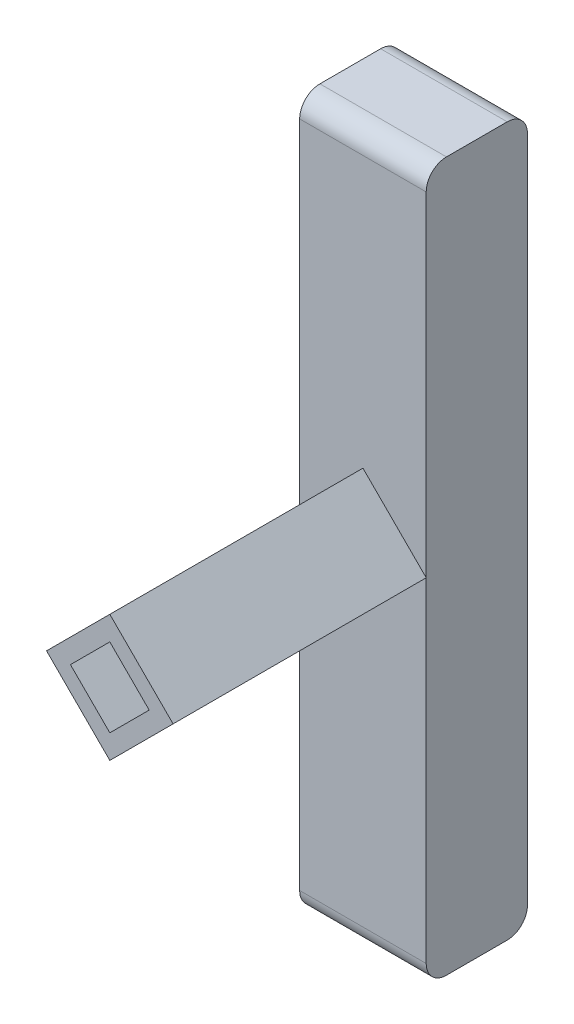
ISO-10303-21;
HEADER;
FILE_DESCRIPTION(('STEP AP214'),'2;1');
FILE_NAME('part.step','',(''),(''),'','','');
FILE_SCHEMA(('AUTOMOTIVE_DESIGN { 1 0 10303 214 1 1 1 1 }'));
ENDSEC;
DATA;
#1=APPLICATION_CONTEXT('core data for automotive mechanical design processes');
#2=APPLICATION_PROTOCOL_DEFINITION('international standard','automotive_design',2000,#1);
#3=PRODUCT_CONTEXT('',#1,'mechanical');
#4=PRODUCT('Part','Part','',(#3));
#5=PRODUCT_RELATED_PRODUCT_CATEGORY('part','',(#4));
#6=PRODUCT_DEFINITION_FORMATION('','',#4);
#7=PRODUCT_DEFINITION_CONTEXT('part definition',#1,'design');
#8=PRODUCT_DEFINITION('design','',#6,#7);
#9=PRODUCT_DEFINITION_SHAPE('','',#8);
#10=(LENGTH_UNIT() NAMED_UNIT(*) SI_UNIT(.MILLI.,.METRE.));
#11=(NAMED_UNIT(*) PLANE_ANGLE_UNIT() SI_UNIT($,.RADIAN.));
#12=(NAMED_UNIT(*) SI_UNIT($,.STERADIAN.) SOLID_ANGLE_UNIT());
#13=UNCERTAINTY_MEASURE_WITH_UNIT(LENGTH_MEASURE(1.E-05),#10,'distance_accuracy_value','');
#14=(GEOMETRIC_REPRESENTATION_CONTEXT(3) GLOBAL_UNCERTAINTY_ASSIGNED_CONTEXT((#13)) GLOBAL_UNIT_ASSIGNED_CONTEXT((#10,
#11,#12)) REPRESENTATION_CONTEXT('',''));
#15=CARTESIAN_POINT('',(0.,0.,0.));
#16=DIRECTION('',(0.,0.,1.));
#17=DIRECTION('',(1.,0.,0.));
#18=AXIS2_PLACEMENT_3D('',#15,#16,#17);
#19=CARTESIAN_POINT('',(0.,0.,10.));
#20=DIRECTION('',(0.,0.,1.));
#21=DIRECTION('',(1.,0.,0.));
#22=AXIS2_PLACEMENT_3D('',#19,#20,#21);
#23=PLANE('',#22);
#24=DIRECTION('',(0.,-1.,0.));
#25=VECTOR('',#24,1.);
#26=CARTESIAN_POINT('',(-6.25000000000001,35.,10.));
#27=LINE('',#26,#25);
#28=CARTESIAN_POINT('',(-6.25,0.,10.));
#29=VERTEX_POINT('',#28);
#30=CARTESIAN_POINT('',(-6.25,-33.,10.));
#31=VERTEX_POINT('',#30);
#32=EDGE_CURVE('E222',#29,#31,#27,.T.);
#33=ORIENTED_EDGE('',*,*,#32,.T.);
#34=DIRECTION('',(1.,0.,0.));
#35=VECTOR('',#34,1.);
#36=CARTESIAN_POINT('',(6.25000000000001,-33.,10.));
#37=LINE('',#36,#35);
#38=CARTESIAN_POINT('',(6.25000000000001,-33.,10.));
#39=VERTEX_POINT('',#38);
#40=EDGE_CURVE('E249',#31,#39,#37,.T.);
#41=ORIENTED_EDGE('',*,*,#40,.T.);
#42=DIRECTION('',(0.,1.,0.));
#43=VECTOR('',#42,1.);
#44=CARTESIAN_POINT('',(6.25,35.,10.));
#45=LINE('',#44,#43);
#46=CARTESIAN_POINT('',(6.25,0.,10.));
#47=VERTEX_POINT('',#46);
#48=EDGE_CURVE('E220',#39,#47,#45,.T.);
#49=ORIENTED_EDGE('',*,*,#48,.T.);
#50=DIRECTION('',(0.707106781186548,0.707106781186547,0.));
#51=VECTOR('',#50,1.);
#52=CARTESIAN_POINT('',(3.125,-3.125,10.));
#53=LINE('',#52,#51);
#54=CARTESIAN_POINT('',(0.,-6.25,10.));
#55=VERTEX_POINT('',#54);
#56=EDGE_CURVE('E213',#55,#47,#53,.T.);
#57=ORIENTED_EDGE('',*,*,#56,.F.);
#58=DIRECTION('',(0.707106781186548,-0.707106781186547,0.));
#59=VECTOR('',#58,1.);
#60=CARTESIAN_POINT('',(-3.125,-3.125,10.));
#61=LINE('',#60,#59);
#62=EDGE_CURVE('E216',#29,#55,#61,.T.);
#63=ORIENTED_EDGE('',*,*,#62,.F.);
#64=EDGE_LOOP('',(#33,#41,#49,#57,#63));
#65=FACE_BOUND('',#64,.T.);
#66=ADVANCED_FACE('F33',(#65),#23,.T.);
#67=CARTESIAN_POINT('',(6.25,35.,10.));
#68=DIRECTION('',(-1.,0.,0.));
#69=DIRECTION('',(0.,-1.,0.));
#70=AXIS2_PLACEMENT_3D('',#67,#68,#69);
#71=PLANE('',#70);
#72=ORIENTED_EDGE('',*,*,#48,.F.);
#73=CARTESIAN_POINT('',(6.25000000000001,-33.,8.));
#74=DIRECTION('',(-1.,0.,0.));
#75=DIRECTION('',(0.,-1.,0.));
#76=AXIS2_PLACEMENT_3D('',#73,#74,#75);
#77=CIRCLE('',#76,2.);
#78=CARTESIAN_POINT('',(6.25000000000001,-35.,8.));
#79=VERTEX_POINT('',#78);
#80=EDGE_CURVE('E258',#39,#79,#77,.F.);
#81=ORIENTED_EDGE('',*,*,#80,.T.);
#82=DIRECTION('',(0.,0.,-1.));
#83=VECTOR('',#82,1.);
#84=CARTESIAN_POINT('',(6.25000000000001,-35.,10.));
#85=LINE('',#84,#83);
#86=CARTESIAN_POINT('',(6.25000000000001,-35.,2.));
#87=VERTEX_POINT('',#86);
#88=EDGE_CURVE('E226',#79,#87,#85,.T.);
#89=ORIENTED_EDGE('',*,*,#88,.T.);
#90=CARTESIAN_POINT('',(6.25000000000001,-33.,2.));
#91=DIRECTION('',(-1.,0.,0.));
#92=DIRECTION('',(0.,-1.,0.));
#93=AXIS2_PLACEMENT_3D('',#90,#91,#92);
#94=CIRCLE('',#93,2.);
#95=CARTESIAN_POINT('',(6.25000000000001,-33.,0.));
#96=VERTEX_POINT('',#95);
#97=EDGE_CURVE('E256',#87,#96,#94,.F.);
#98=ORIENTED_EDGE('',*,*,#97,.T.);
#99=DIRECTION('',(0.,1.,0.));
#100=VECTOR('',#99,1.);
#101=CARTESIAN_POINT('',(6.25,35.,0.));
#102=LINE('',#101,#100);
#103=CARTESIAN_POINT('',(6.25,33.,0.));
#104=VERTEX_POINT('',#103);
#105=EDGE_CURVE('E219',#96,#104,#102,.T.);
#106=ORIENTED_EDGE('',*,*,#105,.T.);
#107=CARTESIAN_POINT('',(6.25,33.,2.));
#108=DIRECTION('',(-1.,0.,0.));
#109=DIRECTION('',(0.,-1.,0.));
#110=AXIS2_PLACEMENT_3D('',#107,#108,#109);
#111=CIRCLE('',#110,2.);
#112=CARTESIAN_POINT('',(6.25,35.,2.));
#113=VERTEX_POINT('',#112);
#114=EDGE_CURVE('E254',#104,#113,#111,.F.);
#115=ORIENTED_EDGE('',*,*,#114,.T.);
#116=DIRECTION('',(0.,0.,-1.));
#117=VECTOR('',#116,1.);
#118=CARTESIAN_POINT('',(6.25,35.,10.));
#119=LINE('',#118,#117);
#120=CARTESIAN_POINT('',(6.25,35.,8.));
#121=VERTEX_POINT('',#120);
#122=EDGE_CURVE('E239',#121,#113,#119,.T.);
#123=ORIENTED_EDGE('',*,*,#122,.F.);
#124=CARTESIAN_POINT('',(6.25,33.,8.));
#125=DIRECTION('',(-1.,0.,0.));
#126=DIRECTION('',(0.,-1.,0.));
#127=AXIS2_PLACEMENT_3D('',#124,#125,#126);
#128=CIRCLE('',#127,2.);
#129=CARTESIAN_POINT('',(6.25,33.,10.));
#130=VERTEX_POINT('',#129);
#131=EDGE_CURVE('E252',#121,#130,#128,.F.);
#132=ORIENTED_EDGE('',*,*,#131,.T.);
#133=EDGE_CURVE('E223',#47,#130,#45,.T.);
#134=ORIENTED_EDGE('',*,*,#133,.F.);
#135=EDGE_LOOP('',(#72,#81,#89,#98,#106,#115,#123,#132,#134));
#136=FACE_BOUND('',#135,.T.);
#137=ADVANCED_FACE('F290',(#136),#71,.F.);
#138=CARTESIAN_POINT('',(-6.25000000000001,35.,10.));
#139=DIRECTION('',(0.,-1.,0.));
#140=DIRECTION('',(0.,0.,-1.));
#141=AXIS2_PLACEMENT_3D('',#138,#139,#140);
#142=PLANE('',#141);
#143=ORIENTED_EDGE('',*,*,#122,.T.);
#144=DIRECTION('',(-1.,0.,0.));
#145=VECTOR('',#144,1.);
#146=CARTESIAN_POINT('',(-6.25000000000001,35.,2.));
#147=LINE('',#146,#145);
#148=CARTESIAN_POINT('',(-6.25000000000001,35.,2.));
#149=VERTEX_POINT('',#148);
#150=EDGE_CURVE('E41',#113,#149,#147,.T.);
#151=ORIENTED_EDGE('',*,*,#150,.T.);
#152=DIRECTION('',(0.,0.,-1.));
#153=VECTOR('',#152,1.);
#154=CARTESIAN_POINT('',(-6.25000000000001,35.,10.));
#155=LINE('',#154,#153);
#156=CARTESIAN_POINT('',(-6.25000000000001,35.,8.));
#157=VERTEX_POINT('',#156);
#158=EDGE_CURVE('E237',#157,#149,#155,.T.);
#159=ORIENTED_EDGE('',*,*,#158,.F.);
#160=DIRECTION('',(-1.,0.,0.));
#161=VECTOR('',#160,1.);
#162=CARTESIAN_POINT('',(6.25,35.,8.));
#163=LINE('',#162,#161);
#164=EDGE_CURVE('E275',#157,#121,#163,.F.);
#165=ORIENTED_EDGE('',*,*,#164,.T.);
#166=EDGE_LOOP('',(#143,#151,#159,#165));
#167=FACE_BOUND('',#166,.T.);
#168=ADVANCED_FACE('F277',(#167),#142,.F.);
#169=CARTESIAN_POINT('',(-6.25000000000001,35.,10.));
#170=DIRECTION('',(1.,0.,0.));
#171=DIRECTION('',(0.,1.,0.));
#172=AXIS2_PLACEMENT_3D('',#169,#170,#171);
#173=PLANE('',#172);
#174=DIRECTION('',(0.,0.,-1.));
#175=VECTOR('',#174,1.);
#176=CARTESIAN_POINT('',(-6.25,-35.,10.));
#177=LINE('',#176,#175);
#178=CARTESIAN_POINT('',(-6.25,-35.,8.));
#179=VERTEX_POINT('',#178);
#180=CARTESIAN_POINT('',(-6.25,-35.,2.));
#181=VERTEX_POINT('',#180);
#182=EDGE_CURVE('E234',#179,#181,#177,.T.);
#183=ORIENTED_EDGE('',*,*,#182,.F.);
#184=CARTESIAN_POINT('',(-6.25,-33.,8.));
#185=DIRECTION('',(1.,0.,0.));
#186=DIRECTION('',(0.,1.,0.));
#187=AXIS2_PLACEMENT_3D('',#184,#185,#186);
#188=CIRCLE('',#187,2.);
#189=EDGE_CURVE('E269',#179,#31,#188,.F.);
#190=ORIENTED_EDGE('',*,*,#189,.T.);
#191=ORIENTED_EDGE('',*,*,#32,.F.);
#192=CARTESIAN_POINT('',(-6.25000000000001,33.,10.));
#193=VERTEX_POINT('',#192);
#194=EDGE_CURVE('E224',#193,#29,#27,.T.);
#195=ORIENTED_EDGE('',*,*,#194,.F.);
#196=CARTESIAN_POINT('',(-6.25000000000001,33.,8.));
#197=DIRECTION('',(1.,0.,0.));
#198=DIRECTION('',(0.,1.,0.));
#199=AXIS2_PLACEMENT_3D('',#196,#197,#198);
#200=CIRCLE('',#199,2.);
#201=EDGE_CURVE('E56',#193,#157,#200,.F.);
#202=ORIENTED_EDGE('',*,*,#201,.T.);
#203=ORIENTED_EDGE('',*,*,#158,.T.);
#204=CARTESIAN_POINT('',(-6.25000000000001,33.,2.));
#205=DIRECTION('',(1.,0.,0.));
#206=DIRECTION('',(0.,1.,0.));
#207=AXIS2_PLACEMENT_3D('',#204,#205,#206);
#208=CIRCLE('',#207,2.);
#209=CARTESIAN_POINT('',(-6.25000000000001,33.,0.));
#210=VERTEX_POINT('',#209);
#211=EDGE_CURVE('E48',#149,#210,#208,.F.);
#212=ORIENTED_EDGE('',*,*,#211,.T.);
#213=DIRECTION('',(0.,-1.,0.));
#214=VECTOR('',#213,1.);
#215=CARTESIAN_POINT('',(-6.25000000000001,35.,0.));
#216=LINE('',#215,#214);
#217=CARTESIAN_POINT('',(-6.25,-33.,0.));
#218=VERTEX_POINT('',#217);
#219=EDGE_CURVE('E229',#210,#218,#216,.T.);
#220=ORIENTED_EDGE('',*,*,#219,.T.);
#221=CARTESIAN_POINT('',(-6.25,-33.,2.));
#222=DIRECTION('',(1.,0.,0.));
#223=DIRECTION('',(0.,1.,0.));
#224=AXIS2_PLACEMENT_3D('',#221,#222,#223);
#225=CIRCLE('',#224,2.);
#226=EDGE_CURVE('E267',#218,#181,#225,.F.);
#227=ORIENTED_EDGE('',*,*,#226,.T.);
#228=EDGE_LOOP('',(#183,#190,#191,#195,#202,#203,#212,#220,#227));
#229=FACE_BOUND('',#228,.T.);
#230=ADVANCED_FACE('F282',(#229),#173,.F.);
#231=CARTESIAN_POINT('',(-6.25,-35.,10.));
#232=DIRECTION('',(0.,1.,0.));
#233=DIRECTION('',(0.,0.,1.));
#234=AXIS2_PLACEMENT_3D('',#231,#232,#233);
#235=PLANE('',#234);
#236=ORIENTED_EDGE('',*,*,#88,.F.);
#237=DIRECTION('',(1.,0.,0.));
#238=VECTOR('',#237,1.);
#239=CARTESIAN_POINT('',(-6.25,-35.,8.));
#240=LINE('',#239,#238);
#241=EDGE_CURVE('E263',#79,#179,#240,.F.);
#242=ORIENTED_EDGE('',*,*,#241,.T.);
#243=ORIENTED_EDGE('',*,*,#182,.T.);
#244=DIRECTION('',(1.,0.,0.));
#245=VECTOR('',#244,1.);
#246=CARTESIAN_POINT('',(-6.25,-35.,2.));
#247=LINE('',#246,#245);
#248=EDGE_CURVE('E260',#181,#87,#247,.T.);
#249=ORIENTED_EDGE('',*,*,#248,.T.);
#250=EDGE_LOOP('',(#236,#242,#243,#249));
#251=FACE_BOUND('',#250,.T.);
#252=ADVANCED_FACE('F298',(#251),#235,.F.);
#253=ORIENTED_EDGE('',*,*,#133,.T.);
#254=DIRECTION('',(-1.,0.,0.));
#255=VECTOR('',#254,1.);
#256=CARTESIAN_POINT('',(-6.25000000000001,33.,10.));
#257=LINE('',#256,#255);
#258=EDGE_CURVE('E11',#130,#193,#257,.T.);
#259=ORIENTED_EDGE('',*,*,#258,.T.);
#260=ORIENTED_EDGE('',*,*,#194,.T.);
#261=DIRECTION('',(-0.707106781186548,-0.707106781186547,0.));
#262=VECTOR('',#261,1.);
#263=CARTESIAN_POINT('',(-3.125,3.125,10.));
#264=LINE('',#263,#262);
#265=CARTESIAN_POINT('',(0.,6.25,10.));
#266=VERTEX_POINT('',#265);
#267=EDGE_CURVE('E199',#266,#29,#264,.T.);
#268=ORIENTED_EDGE('',*,*,#267,.F.);
#269=DIRECTION('',(-0.707106781186548,0.707106781186548,0.));
#270=VECTOR('',#269,1.);
#271=CARTESIAN_POINT('',(3.125,3.125,10.));
#272=LINE('',#271,#270);
#273=EDGE_CURVE('E210',#47,#266,#272,.T.);
#274=ORIENTED_EDGE('',*,*,#273,.F.);
#275=EDGE_LOOP('',(#253,#259,#260,#268,#274));
#276=FACE_BOUND('',#275,.T.);
#277=ADVANCED_FACE('F325',(#276),#23,.T.);
#278=CARTESIAN_POINT('',(0.,0.,0.));
#279=DIRECTION('',(0.,0.,1.));
#280=DIRECTION('',(1.,0.,0.));
#281=AXIS2_PLACEMENT_3D('',#278,#279,#280);
#282=PLANE('',#281);
#283=DIRECTION('',(0.707106781186548,-0.707106781186547,0.));
#284=VECTOR('',#283,1.);
#285=CARTESIAN_POINT('',(3.88908729652601,0.,0.));
#286=LINE('',#285,#284);
#287=CARTESIAN_POINT('',(0.,3.88908729652601,0.));
#288=VERTEX_POINT('',#287);
#289=CARTESIAN_POINT('',(3.88908729652601,0.,0.));
#290=VERTEX_POINT('',#289);
#291=EDGE_CURVE('E164',#288,#290,#286,.T.);
#292=ORIENTED_EDGE('',*,*,#291,.F.);
#293=DIRECTION('',(0.707106781186548,0.707106781186548,0.));
#294=VECTOR('',#293,1.);
#295=CARTESIAN_POINT('',(0.,3.88908729652601,0.));
#296=LINE('',#295,#294);
#297=CARTESIAN_POINT('',(-3.88908729652601,0.,0.));
#298=VERTEX_POINT('',#297);
#299=EDGE_CURVE('E169',#298,#288,#296,.T.);
#300=ORIENTED_EDGE('',*,*,#299,.F.);
#301=DIRECTION('',(-0.707106781186548,0.707106781186548,0.));
#302=VECTOR('',#301,1.);
#303=CARTESIAN_POINT('',(0.,-3.88908729652601,0.));
#304=LINE('',#303,#302);
#305=CARTESIAN_POINT('',(0.,-3.88908729652601,0.));
#306=VERTEX_POINT('',#305);
#307=EDGE_CURVE('E174',#306,#298,#304,.T.);
#308=ORIENTED_EDGE('',*,*,#307,.F.);
#309=DIRECTION('',(-0.707106781186548,-0.707106781186548,0.));
#310=VECTOR('',#309,1.);
#311=CARTESIAN_POINT('',(3.88908729652601,0.,0.));
#312=LINE('',#311,#310);
#313=EDGE_CURVE('E153',#290,#306,#312,.T.);
#314=ORIENTED_EDGE('',*,*,#313,.F.);
#315=EDGE_LOOP('',(#292,#300,#308,#314));
#316=FACE_BOUND('',#315,.T.);
#317=ORIENTED_EDGE('',*,*,#105,.F.);
#318=DIRECTION('',(1.,0.,0.));
#319=VECTOR('',#318,1.);
#320=CARTESIAN_POINT('',(0.,-33.,0.));
#321=LINE('',#320,#319);
#322=EDGE_CURVE('E273',#96,#218,#321,.F.);
#323=ORIENTED_EDGE('',*,*,#322,.T.);
#324=ORIENTED_EDGE('',*,*,#219,.F.);
#325=DIRECTION('',(-1.,0.,0.));
#326=VECTOR('',#325,1.);
#327=CARTESIAN_POINT('',(0.,33.,0.));
#328=LINE('',#327,#326);
#329=EDGE_CURVE('E271',#210,#104,#328,.F.);
#330=ORIENTED_EDGE('',*,*,#329,.T.);
#331=EDGE_LOOP('',(#317,#323,#324,#330));
#332=FACE_BOUND('',#331,.T.);
#333=ADVANCED_FACE('F171',(#316,#332),#282,.F.);
#334=CARTESIAN_POINT('',(-6.25,0.,35.));
#335=DIRECTION('',(-0.707106781186548,-0.707106781186548,0.));
#336=DIRECTION('',(0.707106781186548,-0.707106781186547,0.));
#337=AXIS2_PLACEMENT_3D('',#334,#335,#336);
#338=PLANE('',#337);
#339=DIRECTION('',(0.,0.,-1.));
#340=VECTOR('',#339,1.);
#341=CARTESIAN_POINT('',(-6.25,0.,35.));
#342=LINE('',#341,#340);
#343=CARTESIAN_POINT('',(-6.25,0.,35.));
#344=VERTEX_POINT('',#343);
#345=EDGE_CURVE('E195',#344,#29,#342,.T.);
#346=ORIENTED_EDGE('',*,*,#345,.T.);
#347=ORIENTED_EDGE('',*,*,#62,.T.);
#348=DIRECTION('',(0.,0.,-1.));
#349=VECTOR('',#348,1.);
#350=CARTESIAN_POINT('',(0.,-6.25,35.));
#351=LINE('',#350,#349);
#352=CARTESIAN_POINT('',(0.,-6.25,35.));
#353=VERTEX_POINT('',#352);
#354=EDGE_CURVE('E196',#353,#55,#351,.T.);
#355=ORIENTED_EDGE('',*,*,#354,.F.);
#356=DIRECTION('',(-0.707106781186548,0.707106781186547,0.));
#357=VECTOR('',#356,1.);
#358=CARTESIAN_POINT('',(-6.25,0.,35.));
#359=LINE('',#358,#357);
#360=EDGE_CURVE('E181',#353,#344,#359,.T.);
#361=ORIENTED_EDGE('',*,*,#360,.T.);
#362=EDGE_LOOP('',(#346,#347,#355,#361));
#363=FACE_BOUND('',#362,.T.);
#364=ADVANCED_FACE('F313',(#363),#338,.T.);
#365=CARTESIAN_POINT('',(0.,-6.25,35.));
#366=DIRECTION('',(0.707106781186548,-0.707106781186548,0.));
#367=DIRECTION('',(0.707106781186548,0.707106781186547,0.));
#368=AXIS2_PLACEMENT_3D('',#365,#366,#367);
#369=PLANE('',#368);
#370=ORIENTED_EDGE('',*,*,#354,.T.);
#371=ORIENTED_EDGE('',*,*,#56,.T.);
#372=DIRECTION('',(0.,0.,-1.));
#373=VECTOR('',#372,1.);
#374=CARTESIAN_POINT('',(6.25,0.,35.));
#375=LINE('',#374,#373);
#376=CARTESIAN_POINT('',(6.25,0.,35.));
#377=VERTEX_POINT('',#376);
#378=EDGE_CURVE('E200',#377,#47,#375,.T.);
#379=ORIENTED_EDGE('',*,*,#378,.F.);
#380=DIRECTION('',(-0.707106781186548,-0.707106781186547,0.));
#381=VECTOR('',#380,1.);
#382=CARTESIAN_POINT('',(0.,-6.25,35.));
#383=LINE('',#382,#381);
#384=EDGE_CURVE('E192',#377,#353,#383,.T.);
#385=ORIENTED_EDGE('',*,*,#384,.T.);
#386=EDGE_LOOP('',(#370,#371,#379,#385));
#387=FACE_BOUND('',#386,.T.);
#388=ADVANCED_FACE('F320',(#387),#369,.T.);
#389=CARTESIAN_POINT('',(0.,6.25,35.));
#390=DIRECTION('',(0.707106781186548,0.707106781186548,0.));
#391=DIRECTION('',(-0.707106781186548,0.707106781186548,0.));
#392=AXIS2_PLACEMENT_3D('',#389,#390,#391);
#393=PLANE('',#392);
#394=ORIENTED_EDGE('',*,*,#378,.T.);
#395=ORIENTED_EDGE('',*,*,#273,.T.);
#396=DIRECTION('',(0.,0.,-1.));
#397=VECTOR('',#396,1.);
#398=CARTESIAN_POINT('',(0.,6.25,35.));
#399=LINE('',#398,#397);
#400=CARTESIAN_POINT('',(0.,6.25,35.));
#401=VERTEX_POINT('',#400);
#402=EDGE_CURVE('E203',#401,#266,#399,.T.);
#403=ORIENTED_EDGE('',*,*,#402,.F.);
#404=DIRECTION('',(0.707106781186547,-0.707106781186547,0.));
#405=VECTOR('',#404,1.);
#406=CARTESIAN_POINT('',(0.,6.25,35.));
#407=LINE('',#406,#405);
#408=EDGE_CURVE('E189',#401,#377,#407,.T.);
#409=ORIENTED_EDGE('',*,*,#408,.T.);
#410=EDGE_LOOP('',(#394,#395,#403,#409));
#411=FACE_BOUND('',#410,.T.);
#412=ADVANCED_FACE('F322',(#411),#393,.T.);
#413=CARTESIAN_POINT('',(-6.25,0.,35.));
#414=DIRECTION('',(-0.707106781186548,0.707106781186548,0.));
#415=DIRECTION('',(-0.707106781186548,-0.707106781186547,0.));
#416=AXIS2_PLACEMENT_3D('',#413,#414,#415);
#417=PLANE('',#416);
#418=ORIENTED_EDGE('',*,*,#402,.T.);
#419=ORIENTED_EDGE('',*,*,#267,.T.);
#420=ORIENTED_EDGE('',*,*,#345,.F.);
#421=DIRECTION('',(0.707106781186548,0.707106781186547,0.));
#422=VECTOR('',#421,1.);
#423=CARTESIAN_POINT('',(-6.25,0.,35.));
#424=LINE('',#423,#422);
#425=EDGE_CURVE('E186',#344,#401,#424,.T.);
#426=ORIENTED_EDGE('',*,*,#425,.T.);
#427=EDGE_LOOP('',(#418,#419,#420,#426));
#428=FACE_BOUND('',#427,.T.);
#429=ADVANCED_FACE('F309',(#428),#417,.T.);
#430=CARTESIAN_POINT('',(0.,0.,35.));
#431=DIRECTION('',(0.,0.,1.));
#432=DIRECTION('',(1.,0.,0.));
#433=AXIS2_PLACEMENT_3D('',#430,#431,#432);
#434=PLANE('',#433);
#435=DIRECTION('',(-0.707106781186548,-0.707106781186548,0.));
#436=VECTOR('',#435,1.);
#437=CARTESIAN_POINT('',(-1.94454364826301,1.94454364826301,35.));
#438=LINE('',#437,#436);
#439=CARTESIAN_POINT('',(0.,3.88908729652601,35.));
#440=VERTEX_POINT('',#439);
#441=CARTESIAN_POINT('',(-3.88908729652601,0.,35.));
#442=VERTEX_POINT('',#441);
#443=EDGE_CURVE('E247',#440,#442,#438,.T.);
#444=ORIENTED_EDGE('',*,*,#443,.F.);
#445=DIRECTION('',(-0.707106781186548,0.707106781186547,0.));
#446=VECTOR('',#445,1.);
#447=CARTESIAN_POINT('',(1.94454364826301,1.94454364826301,35.));
#448=LINE('',#447,#446);
#449=CARTESIAN_POINT('',(3.88908729652601,0.,35.));
#450=VERTEX_POINT('',#449);
#451=EDGE_CURVE('E242',#450,#440,#448,.T.);
#452=ORIENTED_EDGE('',*,*,#451,.F.);
#453=DIRECTION('',(0.707106781186548,0.707106781186548,0.));
#454=VECTOR('',#453,1.);
#455=CARTESIAN_POINT('',(1.94454364826301,-1.94454364826301,35.));
#456=LINE('',#455,#454);
#457=CARTESIAN_POINT('',(0.,-3.88908729652601,35.));
#458=VERTEX_POINT('',#457);
#459=EDGE_CURVE('E156',#458,#450,#456,.T.);
#460=ORIENTED_EDGE('',*,*,#459,.F.);
#461=DIRECTION('',(0.707106781186548,-0.707106781186548,0.));
#462=VECTOR('',#461,1.);
#463=CARTESIAN_POINT('',(-1.94454364826301,-1.94454364826301,35.));
#464=LINE('',#463,#462);
#465=EDGE_CURVE('E245',#442,#458,#464,.T.);
#466=ORIENTED_EDGE('',*,*,#465,.F.);
#467=EDGE_LOOP('',(#444,#452,#460,#466));
#468=FACE_BOUND('',#467,.T.);
#469=ORIENTED_EDGE('',*,*,#360,.F.);
#470=ORIENTED_EDGE('',*,*,#384,.F.);
#471=ORIENTED_EDGE('',*,*,#408,.F.);
#472=ORIENTED_EDGE('',*,*,#425,.F.);
#473=EDGE_LOOP('',(#469,#470,#471,#472));
#474=FACE_BOUND('',#473,.T.);
#475=ADVANCED_FACE('F317',(#468,#474),#434,.T.);
#476=CARTESIAN_POINT('',(0.,3.88908729652601,40.));
#477=DIRECTION('',(-0.707106781186548,0.707106781186548,0.));
#478=DIRECTION('',(-0.707106781186548,-0.707106781186548,0.));
#479=AXIS2_PLACEMENT_3D('',#476,#477,#478);
#480=PLANE('',#479);
#481=ORIENTED_EDGE('',*,*,#443,.T.);
#482=DIRECTION('',(0.,0.,-1.));
#483=VECTOR('',#482,1.);
#484=CARTESIAN_POINT('',(-3.88908729652601,0.,40.));
#485=LINE('',#484,#483);
#486=EDGE_CURVE('E179',#442,#298,#485,.T.);
#487=ORIENTED_EDGE('',*,*,#486,.T.);
#488=ORIENTED_EDGE('',*,*,#299,.T.);
#489=DIRECTION('',(0.,0.,-1.));
#490=VECTOR('',#489,1.);
#491=CARTESIAN_POINT('',(0.,3.88908729652601,40.));
#492=LINE('',#491,#490);
#493=EDGE_CURVE('E160',#440,#288,#492,.T.);
#494=ORIENTED_EDGE('',*,*,#493,.F.);
#495=EDGE_LOOP('',(#481,#487,#488,#494));
#496=FACE_BOUND('',#495,.T.);
#497=ADVANCED_FACE('F400',(#496),#480,.F.);
#498=CARTESIAN_POINT('',(0.,-3.88908729652601,40.));
#499=DIRECTION('',(-0.707106781186548,-0.707106781186548,0.));
#500=DIRECTION('',(0.707106781186548,-0.707106781186548,0.));
#501=AXIS2_PLACEMENT_3D('',#498,#499,#500);
#502=PLANE('',#501);
#503=ORIENTED_EDGE('',*,*,#465,.T.);
#504=DIRECTION('',(0.,0.,-1.));
#505=VECTOR('',#504,1.);
#506=CARTESIAN_POINT('',(0.,-3.88908729652601,40.));
#507=LINE('',#506,#505);
#508=EDGE_CURVE('E159',#458,#306,#507,.T.);
#509=ORIENTED_EDGE('',*,*,#508,.T.);
#510=ORIENTED_EDGE('',*,*,#307,.T.);
#511=ORIENTED_EDGE('',*,*,#486,.F.);
#512=EDGE_LOOP('',(#503,#509,#510,#511));
#513=FACE_BOUND('',#512,.T.);
#514=ADVANCED_FACE('F392',(#513),#502,.F.);
#515=CARTESIAN_POINT('',(3.88908729652601,0.,40.));
#516=DIRECTION('',(0.707106781186548,-0.707106781186548,0.));
#517=DIRECTION('',(0.707106781186548,0.707106781186548,0.));
#518=AXIS2_PLACEMENT_3D('',#515,#516,#517);
#519=PLANE('',#518);
#520=ORIENTED_EDGE('',*,*,#459,.T.);
#521=DIRECTION('',(0.,0.,-1.));
#522=VECTOR('',#521,1.);
#523=CARTESIAN_POINT('',(3.88908729652601,0.,40.));
#524=LINE('',#523,#522);
#525=EDGE_CURVE('E148',#450,#290,#524,.T.);
#526=ORIENTED_EDGE('',*,*,#525,.T.);
#527=ORIENTED_EDGE('',*,*,#313,.T.);
#528=ORIENTED_EDGE('',*,*,#508,.F.);
#529=EDGE_LOOP('',(#520,#526,#527,#528));
#530=FACE_BOUND('',#529,.T.);
#531=ADVANCED_FACE('F150',(#530),#519,.F.);
#532=CARTESIAN_POINT('',(3.88908729652601,0.,40.));
#533=DIRECTION('',(0.707106781186547,0.707106781186548,0.));
#534=DIRECTION('',(-0.707106781186548,0.707106781186547,0.));
#535=AXIS2_PLACEMENT_3D('',#532,#533,#534);
#536=PLANE('',#535);
#537=ORIENTED_EDGE('',*,*,#451,.T.);
#538=ORIENTED_EDGE('',*,*,#493,.T.);
#539=ORIENTED_EDGE('',*,*,#291,.T.);
#540=ORIENTED_EDGE('',*,*,#525,.F.);
#541=EDGE_LOOP('',(#537,#538,#539,#540));
#542=FACE_BOUND('',#541,.T.);
#543=ADVANCED_FACE('F165',(#542),#536,.F.);
#544=CARTESIAN_POINT('',(0.,-33.,8.));
#545=DIRECTION('',(-1.,0.,0.));
#546=DIRECTION('',(0.,0.,1.));
#547=AXIS2_PLACEMENT_3D('',#544,#545,#546);
#548=CYLINDRICAL_SURFACE('',#547,2.);
#549=ORIENTED_EDGE('',*,*,#189,.F.);
#550=ORIENTED_EDGE('',*,*,#241,.F.);
#551=ORIENTED_EDGE('',*,*,#80,.F.);
#552=ORIENTED_EDGE('',*,*,#40,.F.);
#553=EDGE_LOOP('',(#549,#550,#551,#552));
#554=FACE_BOUND('',#553,.T.);
#555=ADVANCED_FACE('F301',(#554),#548,.T.);
#556=CARTESIAN_POINT('',(-6.25,-33.,2.));
#557=DIRECTION('',(1.,0.,0.));
#558=DIRECTION('',(0.,0.,-1.));
#559=AXIS2_PLACEMENT_3D('',#556,#557,#558);
#560=CYLINDRICAL_SURFACE('',#559,2.);
#561=ORIENTED_EDGE('',*,*,#226,.F.);
#562=ORIENTED_EDGE('',*,*,#322,.F.);
#563=ORIENTED_EDGE('',*,*,#97,.F.);
#564=ORIENTED_EDGE('',*,*,#248,.F.);
#565=EDGE_LOOP('',(#561,#562,#563,#564));
#566=FACE_BOUND('',#565,.T.);
#567=ADVANCED_FACE('F293',(#566),#560,.T.);
#568=CARTESIAN_POINT('',(-6.25000000000001,33.,2.));
#569=DIRECTION('',(-1.,0.,0.));
#570=DIRECTION('',(0.,0.,1.));
#571=AXIS2_PLACEMENT_3D('',#568,#569,#570);
#572=CYLINDRICAL_SURFACE('',#571,2.);
#573=ORIENTED_EDGE('',*,*,#114,.F.);
#574=ORIENTED_EDGE('',*,*,#329,.F.);
#575=ORIENTED_EDGE('',*,*,#211,.F.);
#576=ORIENTED_EDGE('',*,*,#150,.F.);
#577=EDGE_LOOP('',(#573,#574,#575,#576));
#578=FACE_BOUND('',#577,.T.);
#579=ADVANCED_FACE('F287',(#578),#572,.T.);
#580=CARTESIAN_POINT('',(0.,33.,8.));
#581=DIRECTION('',(1.,0.,0.));
#582=DIRECTION('',(0.,0.,-1.));
#583=AXIS2_PLACEMENT_3D('',#580,#581,#582);
#584=CYLINDRICAL_SURFACE('',#583,2.);
#585=ORIENTED_EDGE('',*,*,#131,.F.);
#586=ORIENTED_EDGE('',*,*,#164,.F.);
#587=ORIENTED_EDGE('',*,*,#201,.F.);
#588=ORIENTED_EDGE('',*,*,#258,.F.);
#589=EDGE_LOOP('',(#585,#586,#587,#588));
#590=FACE_BOUND('',#589,.T.);
#591=ADVANCED_FACE('F35',(#590),#584,.T.);
#592=CLOSED_SHELL('',(#66,#137,#168,#230,#252,#277,#333,#364,#388,#412,#429,#475,#497,#514,#531,
#543,#555,#567,#579,#591));
#593=MANIFOLD_SOLID_BREP('B2',#592);
#594=ADVANCED_BREP_SHAPE_REPRESENTATION('',(#18,#593),#14);
#595=SHAPE_DEFINITION_REPRESENTATION(#9,#594);
ENDSEC;
END-ISO-10303-21;
